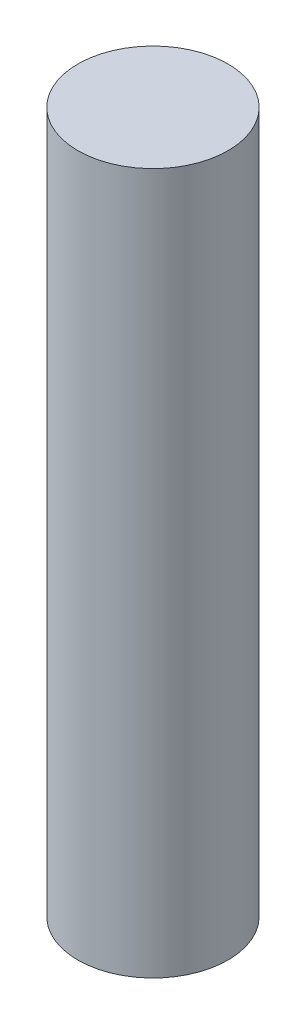
ISO-10303-21;
HEADER;
FILE_DESCRIPTION(('STEP AP214'),'2;1');
FILE_NAME('part.step','',(''),(''),'','','');
FILE_SCHEMA(('AUTOMOTIVE_DESIGN { 1 0 10303 214 1 1 1 1 }'));
ENDSEC;
DATA;
#1=APPLICATION_CONTEXT('core data for automotive mechanical design processes');
#2=APPLICATION_PROTOCOL_DEFINITION('international standard','automotive_design',2000,#1);
#3=PRODUCT_CONTEXT('',#1,'mechanical');
#4=PRODUCT('Part','Part','',(#3));
#5=PRODUCT_RELATED_PRODUCT_CATEGORY('part','',(#4));
#6=PRODUCT_DEFINITION_FORMATION('','',#4);
#7=PRODUCT_DEFINITION_CONTEXT('part definition',#1,'design');
#8=PRODUCT_DEFINITION('design','',#6,#7);
#9=PRODUCT_DEFINITION_SHAPE('','',#8);
#10=(LENGTH_UNIT() NAMED_UNIT(*) SI_UNIT(.MILLI.,.METRE.));
#11=(NAMED_UNIT(*) PLANE_ANGLE_UNIT() SI_UNIT($,.RADIAN.));
#12=(NAMED_UNIT(*) SI_UNIT($,.STERADIAN.) SOLID_ANGLE_UNIT());
#13=UNCERTAINTY_MEASURE_WITH_UNIT(LENGTH_MEASURE(1.E-05),#10,'distance_accuracy_value','');
#14=(GEOMETRIC_REPRESENTATION_CONTEXT(3) GLOBAL_UNCERTAINTY_ASSIGNED_CONTEXT((#13)) GLOBAL_UNIT_ASSIGNED_CONTEXT((#10,
#11,#12)) REPRESENTATION_CONTEXT('',''));
#15=CARTESIAN_POINT('',(0.,0.,0.));
#16=DIRECTION('',(0.,0.,1.));
#17=DIRECTION('',(1.,0.,0.));
#18=AXIS2_PLACEMENT_3D('',#15,#16,#17);
#19=CARTESIAN_POINT('',(0.,88.9,0.));
#20=DIRECTION('',(0.,-1.,0.));
#21=DIRECTION('',(0.,0.,-1.));
#22=AXIS2_PLACEMENT_3D('',#19,#20,#21);
#23=CYLINDRICAL_SURFACE('',#22,9.525);
#24=CARTESIAN_POINT('',(0.,88.9,0.));
#25=DIRECTION('',(0.,1.,0.));
#26=DIRECTION('',(0.,0.,1.));
#27=AXIS2_PLACEMENT_3D('',#24,#25,#26);
#28=CIRCLE('',#27,9.525);
#29=CARTESIAN_POINT('',(0.,88.9,9.525));
#30=VERTEX_POINT('',#29);
#31=EDGE_CURVE('E10',#30,#30,#28,.T.);
#32=ORIENTED_EDGE('',*,*,#31,.F.);
#33=EDGE_LOOP('',(#32));
#34=FACE_BOUND('',#33,.T.);
#35=CARTESIAN_POINT('',(0.,0.,0.));
#36=DIRECTION('',(0.,1.,0.));
#37=DIRECTION('',(0.,0.,1.));
#38=AXIS2_PLACEMENT_3D('',#35,#36,#37);
#39=CIRCLE('',#38,9.525);
#40=CARTESIAN_POINT('',(0.,0.,9.525));
#41=VERTEX_POINT('',#40);
#42=EDGE_CURVE('E35',#41,#41,#39,.T.);
#43=ORIENTED_EDGE('',*,*,#42,.T.);
#44=EDGE_LOOP('',(#43));
#45=FACE_BOUND('',#44,.T.);
#46=ADVANCED_FACE('F32',(#34,#45),#23,.T.);
#47=CARTESIAN_POINT('',(0.,88.9,0.));
#48=DIRECTION('',(0.,1.,0.));
#49=DIRECTION('',(0.,0.,1.));
#50=AXIS2_PLACEMENT_3D('',#47,#48,#49);
#51=PLANE('',#50);
#52=ORIENTED_EDGE('',*,*,#31,.T.);
#53=EDGE_LOOP('',(#52));
#54=FACE_BOUND('',#53,.T.);
#55=ADVANCED_FACE('F47',(#54),#51,.T.);
#56=CARTESIAN_POINT('',(0.,0.,0.));
#57=DIRECTION('',(0.,1.,0.));
#58=DIRECTION('',(0.,0.,1.));
#59=AXIS2_PLACEMENT_3D('',#56,#57,#58);
#60=PLANE('',#59);
#61=ORIENTED_EDGE('',*,*,#42,.F.);
#62=EDGE_LOOP('',(#61));
#63=FACE_BOUND('',#62,.T.);
#64=ADVANCED_FACE('F45',(#63),#60,.F.);
#65=CLOSED_SHELL('',(#46,#55,#64));
#66=MANIFOLD_SOLID_BREP('B2',#65);
#67=ADVANCED_BREP_SHAPE_REPRESENTATION('',(#18,#66),#14);
#68=SHAPE_DEFINITION_REPRESENTATION(#9,#67);
ENDSEC;
END-ISO-10303-21;
